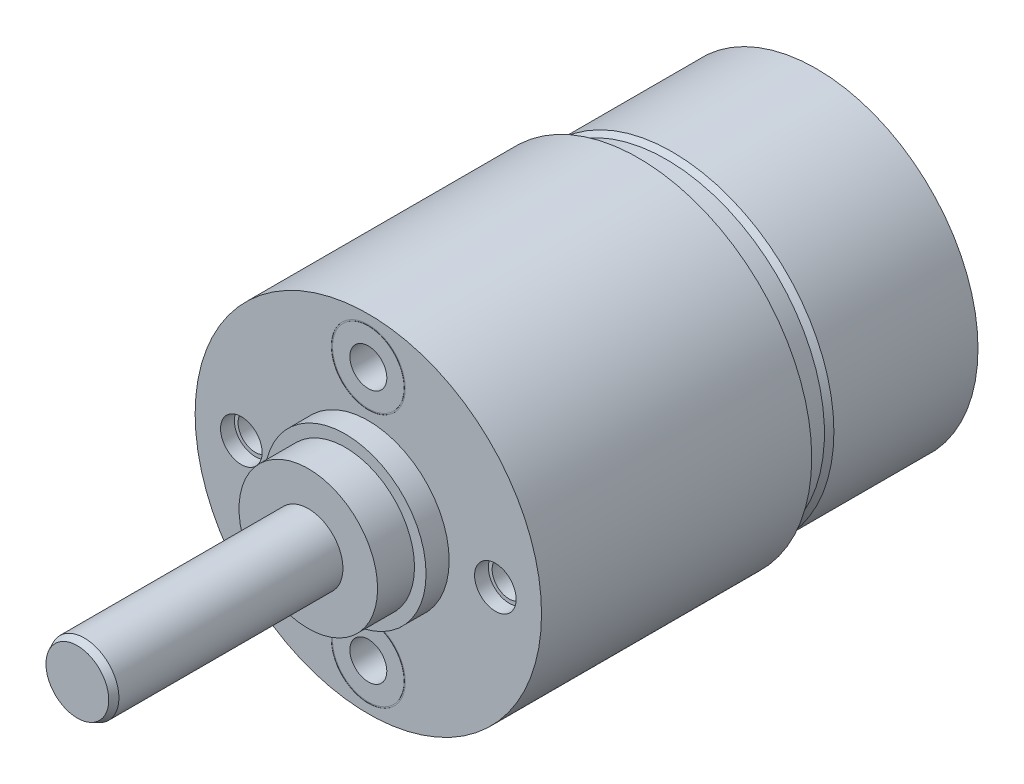
ISO-10303-21;
HEADER;
FILE_DESCRIPTION(('STEP AP214'),'2;1');
FILE_NAME('part.step','',(''),(''),'','','');
FILE_SCHEMA(('AUTOMOTIVE_DESIGN { 1 0 10303 214 1 1 1 1 }'));
ENDSEC;
DATA;
#1=APPLICATION_CONTEXT('core data for automotive mechanical design processes');
#2=APPLICATION_PROTOCOL_DEFINITION('international standard','automotive_design',2000,#1);
#3=PRODUCT_CONTEXT('',#1,'mechanical');
#4=PRODUCT('Part','Part','',(#3));
#5=PRODUCT_RELATED_PRODUCT_CATEGORY('part','',(#4));
#6=PRODUCT_DEFINITION_FORMATION('','',#4);
#7=PRODUCT_DEFINITION_CONTEXT('part definition',#1,'design');
#8=PRODUCT_DEFINITION('design','',#6,#7);
#9=PRODUCT_DEFINITION_SHAPE('','',#8);
#10=(LENGTH_UNIT() NAMED_UNIT(*) SI_UNIT(.MILLI.,.METRE.));
#11=(NAMED_UNIT(*) PLANE_ANGLE_UNIT() SI_UNIT($,.RADIAN.));
#12=(NAMED_UNIT(*) SI_UNIT($,.STERADIAN.) SOLID_ANGLE_UNIT());
#13=UNCERTAINTY_MEASURE_WITH_UNIT(LENGTH_MEASURE(1.E-05),#10,'distance_accuracy_value','');
#14=(GEOMETRIC_REPRESENTATION_CONTEXT(3) GLOBAL_UNCERTAINTY_ASSIGNED_CONTEXT((#13)) GLOBAL_UNIT_ASSIGNED_CONTEXT((#10,
#11,#12)) REPRESENTATION_CONTEXT('',''));
#15=CARTESIAN_POINT('',(0.,0.,0.));
#16=DIRECTION('',(0.,0.,1.));
#17=DIRECTION('',(1.,0.,0.));
#18=AXIS2_PLACEMENT_3D('',#15,#16,#17);
#19=CARTESIAN_POINT('',(0.,0.,-19.4));
#20=DIRECTION('',(0.,0.,-1.));
#21=DIRECTION('',(-1.,0.,0.));
#22=AXIS2_PLACEMENT_3D('',#19,#20,#21);
#23=PLANE('',#22);
#24=CARTESIAN_POINT('',(0.,0.,-19.4));
#25=DIRECTION('',(0.,0.,1.));
#26=DIRECTION('',(1.,0.,0.));
#27=AXIS2_PLACEMENT_3D('',#24,#25,#26);
#28=CIRCLE('',#27,6.4);
#29=CARTESIAN_POINT('',(6.4,0.,-19.4));
#30=VERTEX_POINT('',#29);
#31=EDGE_CURVE('E69',#30,#30,#28,.T.);
#32=ORIENTED_EDGE('',*,*,#31,.T.);
#33=EDGE_LOOP('',(#32));
#34=FACE_BOUND('',#33,.T.);
#35=CARTESIAN_POINT('',(0.,0.,-19.4));
#36=DIRECTION('',(0.,0.,-1.));
#37=DIRECTION('',(-1.,0.,0.));
#38=AXIS2_PLACEMENT_3D('',#35,#36,#37);
#39=CIRCLE('',#38,7.);
#40=CARTESIAN_POINT('',(-7.,0.,-19.4));
#41=VERTEX_POINT('',#40);
#42=EDGE_CURVE('E18',#41,#41,#39,.T.);
#43=ORIENTED_EDGE('',*,*,#42,.T.);
#44=EDGE_LOOP('',(#43));
#45=FACE_BOUND('',#44,.T.);
#46=ADVANCED_FACE('F14',(#34,#45),#23,.T.);
#47=CARTESIAN_POINT('',(0.,0.,0.));
#48=DIRECTION('',(0.,0.,1.));
#49=DIRECTION('',(1.,0.,0.));
#50=AXIS2_PLACEMENT_3D('',#47,#48,#49);
#51=PLANE('',#50);
#52=CARTESIAN_POINT('',(5.5,0.,0.));
#53=DIRECTION('',(0.,0.,-1.));
#54=DIRECTION('',(1.,0.,0.));
#55=AXIS2_PLACEMENT_3D('',#52,#53,#54);
#56=CIRCLE('',#55,0.9);
#57=CARTESIAN_POINT('',(6.4,0.,0.));
#58=VERTEX_POINT('',#57);
#59=EDGE_CURVE('E68',#58,#58,#56,.T.);
#60=ORIENTED_EDGE('',*,*,#59,.T.);
#61=EDGE_LOOP('',(#60));
#62=FACE_BOUND('',#61,.T.);
#63=CARTESIAN_POINT('',(-5.5,0.,0.));
#64=DIRECTION('',(0.,0.,-1.));
#65=DIRECTION('',(-1.,0.,0.));
#66=AXIS2_PLACEMENT_3D('',#63,#64,#65);
#67=CIRCLE('',#66,0.9);
#68=CARTESIAN_POINT('',(-6.4,0.,0.));
#69=VERTEX_POINT('',#68);
#70=EDGE_CURVE('E85',#69,#69,#67,.T.);
#71=ORIENTED_EDGE('',*,*,#70,.T.);
#72=EDGE_LOOP('',(#71));
#73=FACE_BOUND('',#72,.T.);
#74=CARTESIAN_POINT('',(0.,-5.5,0.));
#75=DIRECTION('',(0.,0.,1.));
#76=DIRECTION('',(1.,0.,0.));
#77=AXIS2_PLACEMENT_3D('',#74,#75,#76);
#78=CIRCLE('',#77,1.6);
#79=CARTESIAN_POINT('',(1.6,-5.5,0.));
#80=VERTEX_POINT('',#79);
#81=EDGE_CURVE('E111',#80,#80,#78,.T.);
#82=ORIENTED_EDGE('',*,*,#81,.F.);
#83=EDGE_LOOP('',(#82));
#84=FACE_BOUND('',#83,.T.);
#85=CARTESIAN_POINT('',(0.,0.,0.));
#86=DIRECTION('',(0.,0.,1.));
#87=DIRECTION('',(1.,0.,0.));
#88=AXIS2_PLACEMENT_3D('',#85,#86,#87);
#89=CIRCLE('',#88,3.5);
#90=CARTESIAN_POINT('',(3.5,0.,0.));
#91=VERTEX_POINT('',#90);
#92=EDGE_CURVE('E162',#91,#91,#89,.T.);
#93=ORIENTED_EDGE('',*,*,#92,.F.);
#94=EDGE_LOOP('',(#93));
#95=FACE_BOUND('',#94,.T.);
#96=CARTESIAN_POINT('',(0.,0.,0.));
#97=DIRECTION('',(0.,0.,-1.));
#98=DIRECTION('',(-1.,0.,0.));
#99=AXIS2_PLACEMENT_3D('',#96,#97,#98);
#100=CIRCLE('',#99,7.5);
#101=CARTESIAN_POINT('',(-7.5,0.,0.));
#102=VERTEX_POINT('',#101);
#103=EDGE_CURVE('E158',#102,#102,#100,.T.);
#104=ORIENTED_EDGE('',*,*,#103,.F.);
#105=EDGE_LOOP('',(#104));
#106=FACE_BOUND('',#105,.T.);
#107=CARTESIAN_POINT('',(0.,5.5,0.));
#108=DIRECTION('',(0.,0.,-1.));
#109=DIRECTION('',(1.,0.,0.));
#110=AXIS2_PLACEMENT_3D('',#107,#108,#109);
#111=CIRCLE('',#110,1.6);
#112=CARTESIAN_POINT('',(1.6,5.5,0.));
#113=VERTEX_POINT('',#112);
#114=EDGE_CURVE('E101',#113,#113,#111,.T.);
#115=ORIENTED_EDGE('',*,*,#114,.T.);
#116=EDGE_LOOP('',(#115));
#117=FACE_BOUND('',#116,.T.);
#118=ADVANCED_FACE('F210',(#62,#73,#84,#95,#106,#117),#51,.T.);
#119=CARTESIAN_POINT('',(0.,0.,2.6));
#120=DIRECTION('',(0.,0.,1.));
#121=DIRECTION('',(1.,0.,0.));
#122=AXIS2_PLACEMENT_3D('',#119,#120,#121);
#123=PLANE('',#122);
#124=CARTESIAN_POINT('',(0.,0.,2.6));
#125=DIRECTION('',(0.,0.,1.));
#126=DIRECTION('',(1.,0.,0.));
#127=AXIS2_PLACEMENT_3D('',#124,#125,#126);
#128=CIRCLE('',#127,3.);
#129=CARTESIAN_POINT('',(3.,0.,2.6));
#130=VERTEX_POINT('',#129);
#131=EDGE_CURVE('E150',#130,#130,#128,.T.);
#132=ORIENTED_EDGE('',*,*,#131,.T.);
#133=EDGE_LOOP('',(#132));
#134=FACE_BOUND('',#133,.T.);
#135=CARTESIAN_POINT('',(0.,0.,2.6));
#136=DIRECTION('',(0.,0.,1.));
#137=DIRECTION('',(1.,0.,0.));
#138=AXIS2_PLACEMENT_3D('',#135,#136,#137);
#139=CIRCLE('',#138,1.5);
#140=CARTESIAN_POINT('',(1.5,0.,2.6));
#141=VERTEX_POINT('',#140);
#142=EDGE_CURVE('E146',#141,#141,#139,.F.);
#143=ORIENTED_EDGE('',*,*,#142,.T.);
#144=EDGE_LOOP('',(#143));
#145=FACE_BOUND('',#144,.T.);
#146=ADVANCED_FACE('F215',(#134,#145),#123,.T.);
#147=CARTESIAN_POINT('',(0.,0.,0.));
#148=DIRECTION('',(0.,0.,-1.));
#149=DIRECTION('',(-1.,0.,0.));
#150=AXIS2_PLACEMENT_3D('',#147,#148,#149);
#151=CYLINDRICAL_SURFACE('',#150,7.5);
#152=CARTESIAN_POINT('',(0.,0.,-11.7));
#153=DIRECTION('',(0.,0.,-1.));
#154=DIRECTION('',(-1.,0.,0.));
#155=AXIS2_PLACEMENT_3D('',#152,#153,#154);
#156=CIRCLE('',#155,7.5);
#157=CARTESIAN_POINT('',(-7.5,0.,-11.7));
#158=VERTEX_POINT('',#157);
#159=EDGE_CURVE('E55',#158,#158,#156,.T.);
#160=ORIENTED_EDGE('',*,*,#159,.F.);
#161=EDGE_LOOP('',(#160));
#162=FACE_BOUND('',#161,.T.);
#163=ORIENTED_EDGE('',*,*,#103,.T.);
#164=EDGE_LOOP('',(#163));
#165=FACE_BOUND('',#164,.T.);
#166=ADVANCED_FACE('F221',(#162,#165),#151,.T.);
#167=CARTESIAN_POINT('',(0.,0.,1.));
#168=DIRECTION('',(0.,0.,1.));
#169=DIRECTION('',(1.,0.,0.));
#170=AXIS2_PLACEMENT_3D('',#167,#168,#169);
#171=PLANE('',#170);
#172=CARTESIAN_POINT('',(0.,0.,1.));
#173=DIRECTION('',(0.,0.,1.));
#174=DIRECTION('',(1.,0.,0.));
#175=AXIS2_PLACEMENT_3D('',#172,#173,#174);
#176=CIRCLE('',#175,3.);
#177=CARTESIAN_POINT('',(3.,0.,1.));
#178=VERTEX_POINT('',#177);
#179=EDGE_CURVE('E166',#178,#178,#176,.T.);
#180=ORIENTED_EDGE('',*,*,#179,.F.);
#181=EDGE_LOOP('',(#180));
#182=FACE_BOUND('',#181,.T.);
#183=CARTESIAN_POINT('',(0.,0.,1.));
#184=DIRECTION('',(0.,0.,-1.));
#185=DIRECTION('',(-1.,0.,0.));
#186=AXIS2_PLACEMENT_3D('',#183,#184,#185);
#187=CIRCLE('',#186,3.5);
#188=CARTESIAN_POINT('',(-3.5,0.,1.));
#189=VERTEX_POINT('',#188);
#190=EDGE_CURVE('E154',#189,#189,#187,.T.);
#191=ORIENTED_EDGE('',*,*,#190,.F.);
#192=EDGE_LOOP('',(#191));
#193=FACE_BOUND('',#192,.T.);
#194=ADVANCED_FACE('F223',(#182,#193),#171,.T.);
#195=CARTESIAN_POINT('',(0.,0.,0.));
#196=DIRECTION('',(0.,0.,1.));
#197=DIRECTION('',(1.,0.,0.));
#198=AXIS2_PLACEMENT_3D('',#195,#196,#197);
#199=CYLINDRICAL_SURFACE('',#198,3.5);
#200=ORIENTED_EDGE('',*,*,#190,.T.);
#201=EDGE_LOOP('',(#200));
#202=FACE_BOUND('',#201,.T.);
#203=ORIENTED_EDGE('',*,*,#92,.T.);
#204=EDGE_LOOP('',(#203));
#205=FACE_BOUND('',#204,.T.);
#206=ADVANCED_FACE('F229',(#202,#205),#199,.T.);
#207=CARTESIAN_POINT('',(0.,0.,0.));
#208=DIRECTION('',(0.,0.,1.));
#209=DIRECTION('',(1.,0.,0.));
#210=AXIS2_PLACEMENT_3D('',#207,#208,#209);
#211=CYLINDRICAL_SURFACE('',#210,3.);
#212=ORIENTED_EDGE('',*,*,#179,.T.);
#213=EDGE_LOOP('',(#212));
#214=FACE_BOUND('',#213,.T.);
#215=ORIENTED_EDGE('',*,*,#131,.F.);
#216=EDGE_LOOP('',(#215));
#217=FACE_BOUND('',#216,.T.);
#218=ADVANCED_FACE('F291',(#214,#217),#211,.T.);
#219=CARTESIAN_POINT('',(0.,0.,12.6));
#220=DIRECTION('',(0.,0.,-1.));
#221=DIRECTION('',(-1.,0.,0.));
#222=AXIS2_PLACEMENT_3D('',#219,#220,#221);
#223=CYLINDRICAL_SURFACE('',#222,1.5);
#224=CARTESIAN_POINT('',(0.,0.,12.3));
#225=DIRECTION('',(0.,0.,1.));
#226=DIRECTION('',(1.,0.,0.));
#227=AXIS2_PLACEMENT_3D('',#224,#225,#226);
#228=CIRCLE('',#227,1.5);
#229=CARTESIAN_POINT('',(1.5,0.,12.3));
#230=VERTEX_POINT('',#229);
#231=EDGE_CURVE('E23',#230,#230,#228,.F.);
#232=ORIENTED_EDGE('',*,*,#231,.T.);
#233=EDGE_LOOP('',(#232));
#234=FACE_BOUND('',#233,.T.);
#235=ORIENTED_EDGE('',*,*,#142,.F.);
#236=EDGE_LOOP('',(#235));
#237=FACE_BOUND('',#236,.T.);
#238=ADVANCED_FACE('F288',(#234,#237),#223,.T.);
#239=CARTESIAN_POINT('',(0.,0.,12.6));
#240=DIRECTION('',(0.,0.,1.));
#241=DIRECTION('',(1.,0.,0.));
#242=AXIS2_PLACEMENT_3D('',#239,#240,#241);
#243=PLANE('',#242);
#244=CARTESIAN_POINT('',(0.,0.,12.6));
#245=DIRECTION('',(0.,0.,1.));
#246=DIRECTION('',(1.,0.,0.));
#247=AXIS2_PLACEMENT_3D('',#244,#245,#246);
#248=CIRCLE('',#247,1.3601077025535);
#249=CARTESIAN_POINT('',(1.3601077025535,0.,12.6));
#250=VERTEX_POINT('',#249);
#251=EDGE_CURVE('E33',#250,#250,#248,.T.);
#252=ORIENTED_EDGE('',*,*,#251,.T.);
#253=EDGE_LOOP('',(#252));
#254=FACE_BOUND('',#253,.T.);
#255=ADVANCED_FACE('F285',(#254),#243,.T.);
#256=CARTESIAN_POINT('',(0.,0.,12.6));
#257=DIRECTION('',(0.,0.,-1.));
#258=DIRECTION('',(-1.,0.,0.));
#259=AXIS2_PLACEMENT_3D('',#256,#257,#258);
#260=CONICAL_SURFACE('',#259,1.3601077025535,0.436332312998582);
#261=ORIENTED_EDGE('',*,*,#231,.F.);
#262=EDGE_LOOP('',(#261));
#263=FACE_BOUND('',#262,.T.);
#264=ORIENTED_EDGE('',*,*,#251,.F.);
#265=EDGE_LOOP('',(#264));
#266=FACE_BOUND('',#265,.T.);
#267=ADVANCED_FACE('F16',(#263,#266),#260,.T.);
#268=CARTESIAN_POINT('',(0.,-5.5,-0.01));
#269=DIRECTION('',(0.,0.,1.));
#270=DIRECTION('',(1.,0.,0.));
#271=AXIS2_PLACEMENT_3D('',#268,#269,#270);
#272=CYLINDRICAL_SURFACE('',#271,1.6);
#273=CARTESIAN_POINT('',(0.,-5.5,-0.01));
#274=DIRECTION('',(0.,0.,1.));
#275=DIRECTION('',(1.,0.,0.));
#276=AXIS2_PLACEMENT_3D('',#273,#274,#275);
#277=CIRCLE('',#276,1.6);
#278=CARTESIAN_POINT('',(1.6,-5.5,-0.01));
#279=VERTEX_POINT('',#278);
#280=EDGE_CURVE('E118',#279,#279,#277,.F.);
#281=ORIENTED_EDGE('',*,*,#280,.T.);
#282=EDGE_LOOP('',(#281));
#283=FACE_BOUND('',#282,.T.);
#284=ORIENTED_EDGE('',*,*,#81,.T.);
#285=EDGE_LOOP('',(#284));
#286=FACE_BOUND('',#285,.T.);
#287=ADVANCED_FACE('F266',(#283,#286),#272,.F.);
#288=CARTESIAN_POINT('',(0.,-5.5,-0.01));
#289=DIRECTION('',(0.,0.,1.));
#290=DIRECTION('',(1.,0.,0.));
#291=AXIS2_PLACEMENT_3D('',#288,#289,#290);
#292=CYLINDRICAL_SURFACE('',#291,1.55);
#293=CARTESIAN_POINT('',(0.,-5.5,-0.01));
#294=DIRECTION('',(0.,0.,1.));
#295=DIRECTION('',(1.,0.,0.));
#296=AXIS2_PLACEMENT_3D('',#293,#294,#295);
#297=CIRCLE('',#296,1.55);
#298=CARTESIAN_POINT('',(1.55,-5.5,-0.01));
#299=VERTEX_POINT('',#298);
#300=EDGE_CURVE('E122',#299,#299,#297,.F.);
#301=ORIENTED_EDGE('',*,*,#300,.F.);
#302=EDGE_LOOP('',(#301));
#303=FACE_BOUND('',#302,.T.);
#304=CARTESIAN_POINT('',(0.,-5.5,0.));
#305=DIRECTION('',(0.,0.,1.));
#306=DIRECTION('',(1.,0.,0.));
#307=AXIS2_PLACEMENT_3D('',#304,#305,#306);
#308=CIRCLE('',#307,1.55);
#309=CARTESIAN_POINT('',(1.55,-5.5,0.));
#310=VERTEX_POINT('',#309);
#311=EDGE_CURVE('E123',#310,#310,#308,.T.);
#312=ORIENTED_EDGE('',*,*,#311,.F.);
#313=EDGE_LOOP('',(#312));
#314=FACE_BOUND('',#313,.T.);
#315=ADVANCED_FACE('F262',(#303,#314),#292,.T.);
#316=CARTESIAN_POINT('',(0.,-5.5,-0.01));
#317=DIRECTION('',(0.,0.,1.));
#318=DIRECTION('',(1.,0.,0.));
#319=AXIS2_PLACEMENT_3D('',#316,#317,#318);
#320=PLANE('',#319);
#321=ORIENTED_EDGE('',*,*,#280,.F.);
#322=EDGE_LOOP('',(#321));
#323=FACE_BOUND('',#322,.T.);
#324=ORIENTED_EDGE('',*,*,#300,.T.);
#325=EDGE_LOOP('',(#324));
#326=FACE_BOUND('',#325,.T.);
#327=ADVANCED_FACE('F258',(#323,#326),#320,.T.);
#328=CARTESIAN_POINT('',(0.,-5.5,-4.));
#329=DIRECTION('',(0.,0.,-1.));
#330=DIRECTION('',(1.,0.,0.));
#331=AXIS2_PLACEMENT_3D('',#328,#329,#330);
#332=PLANE('',#331);
#333=CARTESIAN_POINT('',(0.,-5.5,-4.));
#334=DIRECTION('',(0.,0.,-1.));
#335=DIRECTION('',(1.,0.,0.));
#336=AXIS2_PLACEMENT_3D('',#333,#334,#335);
#337=CIRCLE('',#336,0.8);
#338=CARTESIAN_POINT('',(0.8,-5.5,-4.));
#339=VERTEX_POINT('',#338);
#340=EDGE_CURVE('E134',#339,#339,#337,.T.);
#341=ORIENTED_EDGE('',*,*,#340,.F.);
#342=EDGE_LOOP('',(#341));
#343=FACE_BOUND('',#342,.T.);
#344=ADVANCED_FACE('F261',(#343),#332,.F.);
#345=CARTESIAN_POINT('',(0.,-5.5,0.));
#346=DIRECTION('',(0.,0.,-1.));
#347=DIRECTION('',(1.,0.,0.));
#348=AXIS2_PLACEMENT_3D('',#345,#346,#347);
#349=CYLINDRICAL_SURFACE('',#348,0.8);
#350=ORIENTED_EDGE('',*,*,#340,.T.);
#351=EDGE_LOOP('',(#350));
#352=FACE_BOUND('',#351,.T.);
#353=CARTESIAN_POINT('',(0.,-5.5,0.));
#354=DIRECTION('',(0.,0.,-1.));
#355=DIRECTION('',(1.,0.,0.));
#356=AXIS2_PLACEMENT_3D('',#353,#354,#355);
#357=CIRCLE('',#356,0.8);
#358=CARTESIAN_POINT('',(0.8,-5.5,0.));
#359=VERTEX_POINT('',#358);
#360=EDGE_CURVE('E127',#359,#359,#357,.T.);
#361=ORIENTED_EDGE('',*,*,#360,.F.);
#362=EDGE_LOOP('',(#361));
#363=FACE_BOUND('',#362,.T.);
#364=ADVANCED_FACE('F253',(#352,#363),#349,.F.);
#365=ORIENTED_EDGE('',*,*,#360,.T.);
#366=EDGE_LOOP('',(#365));
#367=FACE_BOUND('',#366,.T.);
#368=ORIENTED_EDGE('',*,*,#311,.T.);
#369=EDGE_LOOP('',(#368));
#370=FACE_BOUND('',#369,.T.);
#371=ADVANCED_FACE('F218',(#367,#370),#51,.T.);
#372=CARTESIAN_POINT('',(0.,5.5,-0.01));
#373=DIRECTION('',(0.,0.,1.));
#374=DIRECTION('',(1.,0.,0.));
#375=AXIS2_PLACEMENT_3D('',#372,#373,#374);
#376=CYLINDRICAL_SURFACE('',#375,1.6);
#377=CARTESIAN_POINT('',(0.,5.5,-0.01));
#378=DIRECTION('',(0.,0.,-1.));
#379=DIRECTION('',(1.,0.,0.));
#380=AXIS2_PLACEMENT_3D('',#377,#378,#379);
#381=CIRCLE('',#380,1.6);
#382=CARTESIAN_POINT('',(1.6,5.5,-0.01));
#383=VERTEX_POINT('',#382);
#384=EDGE_CURVE('E102',#383,#383,#381,.F.);
#385=ORIENTED_EDGE('',*,*,#384,.F.);
#386=EDGE_LOOP('',(#385));
#387=FACE_BOUND('',#386,.T.);
#388=ORIENTED_EDGE('',*,*,#114,.F.);
#389=EDGE_LOOP('',(#388));
#390=FACE_BOUND('',#389,.T.);
#391=ADVANCED_FACE('F241',(#387,#390),#376,.F.);
#392=CARTESIAN_POINT('',(0.,5.5,-0.01));
#393=DIRECTION('',(0.,0.,1.));
#394=DIRECTION('',(1.,0.,0.));
#395=AXIS2_PLACEMENT_3D('',#392,#393,#394);
#396=CYLINDRICAL_SURFACE('',#395,1.55);
#397=CARTESIAN_POINT('',(0.,5.5,-0.01));
#398=DIRECTION('',(0.,0.,-1.));
#399=DIRECTION('',(1.,0.,0.));
#400=AXIS2_PLACEMENT_3D('',#397,#398,#399);
#401=CIRCLE('',#400,1.55);
#402=CARTESIAN_POINT('',(1.55,5.5,-0.01));
#403=VERTEX_POINT('',#402);
#404=EDGE_CURVE('E106',#403,#403,#401,.F.);
#405=ORIENTED_EDGE('',*,*,#404,.T.);
#406=EDGE_LOOP('',(#405));
#407=FACE_BOUND('',#406,.T.);
#408=CARTESIAN_POINT('',(0.,5.5,0.));
#409=DIRECTION('',(0.,0.,-1.));
#410=DIRECTION('',(1.,0.,0.));
#411=AXIS2_PLACEMENT_3D('',#408,#409,#410);
#412=CIRCLE('',#411,1.55);
#413=CARTESIAN_POINT('',(1.55,5.5,0.));
#414=VERTEX_POINT('',#413);
#415=EDGE_CURVE('E107',#414,#414,#412,.T.);
#416=ORIENTED_EDGE('',*,*,#415,.T.);
#417=EDGE_LOOP('',(#416));
#418=FACE_BOUND('',#417,.T.);
#419=ADVANCED_FACE('F243',(#407,#418),#396,.T.);
#420=CARTESIAN_POINT('',(0.,5.5,-0.01));
#421=DIRECTION('',(0.,0.,-1.));
#422=DIRECTION('',(-1.,0.,0.));
#423=AXIS2_PLACEMENT_3D('',#420,#421,#422);
#424=PLANE('',#423);
#425=ORIENTED_EDGE('',*,*,#384,.T.);
#426=EDGE_LOOP('',(#425));
#427=FACE_BOUND('',#426,.T.);
#428=ORIENTED_EDGE('',*,*,#404,.F.);
#429=EDGE_LOOP('',(#428));
#430=FACE_BOUND('',#429,.T.);
#431=ADVANCED_FACE('F250',(#427,#430),#424,.F.);
#432=CARTESIAN_POINT('',(0.,5.5,-4.));
#433=DIRECTION('',(0.,0.,-1.));
#434=DIRECTION('',(-1.,0.,0.));
#435=AXIS2_PLACEMENT_3D('',#432,#433,#434);
#436=PLANE('',#435);
#437=CARTESIAN_POINT('',(0.,5.5,-4.));
#438=DIRECTION('',(0.,0.,-1.));
#439=DIRECTION('',(-1.,0.,0.));
#440=AXIS2_PLACEMENT_3D('',#437,#438,#439);
#441=CIRCLE('',#440,0.8);
#442=CARTESIAN_POINT('',(-0.800000000000001,5.5,-4.));
#443=VERTEX_POINT('',#442);
#444=EDGE_CURVE('E142',#443,#443,#441,.T.);
#445=ORIENTED_EDGE('',*,*,#444,.F.);
#446=EDGE_LOOP('',(#445));
#447=FACE_BOUND('',#446,.T.);
#448=ADVANCED_FACE('F277',(#447),#436,.F.);
#449=CARTESIAN_POINT('',(0.,5.5,0.));
#450=DIRECTION('',(0.,0.,-1.));
#451=DIRECTION('',(-1.,0.,0.));
#452=AXIS2_PLACEMENT_3D('',#449,#450,#451);
#453=CYLINDRICAL_SURFACE('',#452,0.8);
#454=ORIENTED_EDGE('',*,*,#444,.T.);
#455=EDGE_LOOP('',(#454));
#456=FACE_BOUND('',#455,.T.);
#457=CARTESIAN_POINT('',(0.,5.5,0.));
#458=DIRECTION('',(0.,0.,-1.));
#459=DIRECTION('',(-1.,0.,0.));
#460=AXIS2_PLACEMENT_3D('',#457,#458,#459);
#461=CIRCLE('',#460,0.8);
#462=CARTESIAN_POINT('',(-0.800000000000001,5.5,0.));
#463=VERTEX_POINT('',#462);
#464=EDGE_CURVE('E138',#463,#463,#461,.T.);
#465=ORIENTED_EDGE('',*,*,#464,.F.);
#466=EDGE_LOOP('',(#465));
#467=FACE_BOUND('',#466,.T.);
#468=ADVANCED_FACE('F280',(#456,#467),#453,.F.);
#469=ORIENTED_EDGE('',*,*,#415,.F.);
#470=EDGE_LOOP('',(#469));
#471=FACE_BOUND('',#470,.T.);
#472=ORIENTED_EDGE('',*,*,#464,.T.);
#473=EDGE_LOOP('',(#472));
#474=FACE_BOUND('',#473,.T.);
#475=ADVANCED_FACE('F219',(#471,#474),#51,.T.);
#476=CARTESIAN_POINT('',(-5.5,0.,-4.));
#477=DIRECTION('',(0.,0.,-1.));
#478=DIRECTION('',(-1.,0.,0.));
#479=AXIS2_PLACEMENT_3D('',#476,#477,#478);
#480=PLANE('',#479);
#481=CARTESIAN_POINT('',(-5.5,0.,-4.));
#482=DIRECTION('',(0.,0.,-1.));
#483=DIRECTION('',(-1.,0.,0.));
#484=AXIS2_PLACEMENT_3D('',#481,#482,#483);
#485=CIRCLE('',#484,0.74);
#486=CARTESIAN_POINT('',(-6.24,0.,-4.));
#487=VERTEX_POINT('',#486);
#488=EDGE_CURVE('E97',#487,#487,#485,.T.);
#489=ORIENTED_EDGE('',*,*,#488,.F.);
#490=EDGE_LOOP('',(#489));
#491=FACE_BOUND('',#490,.T.);
#492=ADVANCED_FACE('F411',(#491),#480,.F.);
#493=CARTESIAN_POINT('',(-5.5,0.,-4.));
#494=DIRECTION('',(0.,0.,-1.));
#495=DIRECTION('',(-1.,0.,0.));
#496=AXIS2_PLACEMENT_3D('',#493,#494,#495);
#497=CYLINDRICAL_SURFACE('',#496,0.74);
#498=ORIENTED_EDGE('',*,*,#488,.T.);
#499=EDGE_LOOP('',(#498));
#500=FACE_BOUND('',#499,.T.);
#501=CARTESIAN_POINT('',(-5.5,0.,-0.6));
#502=DIRECTION('',(0.,0.,-1.));
#503=DIRECTION('',(-1.,0.,0.));
#504=AXIS2_PLACEMENT_3D('',#501,#502,#503);
#505=CIRCLE('',#504,0.74);
#506=CARTESIAN_POINT('',(-6.24,0.,-0.6));
#507=VERTEX_POINT('',#506);
#508=EDGE_CURVE('E93',#507,#507,#505,.T.);
#509=ORIENTED_EDGE('',*,*,#508,.F.);
#510=EDGE_LOOP('',(#509));
#511=FACE_BOUND('',#510,.T.);
#512=ADVANCED_FACE('F421',(#500,#511),#497,.F.);
#513=CARTESIAN_POINT('',(-5.5,0.,-0.6));
#514=DIRECTION('',(0.,0.,-1.));
#515=DIRECTION('',(-1.,0.,0.));
#516=AXIS2_PLACEMENT_3D('',#513,#514,#515);
#517=PLANE('',#516);
#518=ORIENTED_EDGE('',*,*,#508,.T.);
#519=EDGE_LOOP('',(#518));
#520=FACE_BOUND('',#519,.T.);
#521=CARTESIAN_POINT('',(-5.5,0.,-0.6));
#522=DIRECTION('',(0.,0.,-1.));
#523=DIRECTION('',(-1.,0.,0.));
#524=AXIS2_PLACEMENT_3D('',#521,#522,#523);
#525=CIRCLE('',#524,0.9);
#526=CARTESIAN_POINT('',(-6.4,0.,-0.6));
#527=VERTEX_POINT('',#526);
#528=EDGE_CURVE('E89',#527,#527,#525,.T.);
#529=ORIENTED_EDGE('',*,*,#528,.F.);
#530=EDGE_LOOP('',(#529));
#531=FACE_BOUND('',#530,.T.);
#532=ADVANCED_FACE('F432',(#520,#531),#517,.F.);
#533=CARTESIAN_POINT('',(-5.5,0.,0.));
#534=DIRECTION('',(0.,0.,-1.));
#535=DIRECTION('',(-1.,0.,0.));
#536=AXIS2_PLACEMENT_3D('',#533,#534,#535);
#537=CYLINDRICAL_SURFACE('',#536,0.9);
#538=ORIENTED_EDGE('',*,*,#528,.T.);
#539=EDGE_LOOP('',(#538));
#540=FACE_BOUND('',#539,.T.);
#541=ORIENTED_EDGE('',*,*,#70,.F.);
#542=EDGE_LOOP('',(#541));
#543=FACE_BOUND('',#542,.T.);
#544=ADVANCED_FACE('F443',(#540,#543),#537,.F.);
#545=CARTESIAN_POINT('',(5.5,0.,-4.));
#546=DIRECTION('',(0.,0.,-1.));
#547=DIRECTION('',(1.,0.,0.));
#548=AXIS2_PLACEMENT_3D('',#545,#546,#547);
#549=PLANE('',#548);
#550=CARTESIAN_POINT('',(5.5,0.,-4.));
#551=DIRECTION('',(0.,0.,-1.));
#552=DIRECTION('',(1.,0.,0.));
#553=AXIS2_PLACEMENT_3D('',#550,#551,#552);
#554=CIRCLE('',#553,0.74);
#555=CARTESIAN_POINT('',(6.24,0.,-4.));
#556=VERTEX_POINT('',#555);
#557=EDGE_CURVE('E81',#556,#556,#554,.T.);
#558=ORIENTED_EDGE('',*,*,#557,.F.);
#559=EDGE_LOOP('',(#558));
#560=FACE_BOUND('',#559,.T.);
#561=ADVANCED_FACE('F454',(#560),#549,.F.);
#562=CARTESIAN_POINT('',(5.5,0.,-4.));
#563=DIRECTION('',(0.,0.,-1.));
#564=DIRECTION('',(1.,0.,0.));
#565=AXIS2_PLACEMENT_3D('',#562,#563,#564);
#566=CYLINDRICAL_SURFACE('',#565,0.74);
#567=ORIENTED_EDGE('',*,*,#557,.T.);
#568=EDGE_LOOP('',(#567));
#569=FACE_BOUND('',#568,.T.);
#570=CARTESIAN_POINT('',(5.5,0.,-0.6));
#571=DIRECTION('',(0.,0.,-1.));
#572=DIRECTION('',(1.,0.,0.));
#573=AXIS2_PLACEMENT_3D('',#570,#571,#572);
#574=CIRCLE('',#573,0.74);
#575=CARTESIAN_POINT('',(6.24,0.,-0.6));
#576=VERTEX_POINT('',#575);
#577=EDGE_CURVE('E77',#576,#576,#574,.T.);
#578=ORIENTED_EDGE('',*,*,#577,.F.);
#579=EDGE_LOOP('',(#578));
#580=FACE_BOUND('',#579,.T.);
#581=ADVANCED_FACE('F465',(#569,#580),#566,.F.);
#582=CARTESIAN_POINT('',(5.5,0.,-0.6));
#583=DIRECTION('',(0.,0.,-1.));
#584=DIRECTION('',(1.,0.,0.));
#585=AXIS2_PLACEMENT_3D('',#582,#583,#584);
#586=PLANE('',#585);
#587=ORIENTED_EDGE('',*,*,#577,.T.);
#588=EDGE_LOOP('',(#587));
#589=FACE_BOUND('',#588,.T.);
#590=CARTESIAN_POINT('',(5.5,0.,-0.6));
#591=DIRECTION('',(0.,0.,-1.));
#592=DIRECTION('',(1.,0.,0.));
#593=AXIS2_PLACEMENT_3D('',#590,#591,#592);
#594=CIRCLE('',#593,0.9);
#595=CARTESIAN_POINT('',(6.4,0.,-0.6));
#596=VERTEX_POINT('',#595);
#597=EDGE_CURVE('E73',#596,#596,#594,.T.);
#598=ORIENTED_EDGE('',*,*,#597,.F.);
#599=EDGE_LOOP('',(#598));
#600=FACE_BOUND('',#599,.T.);
#601=ADVANCED_FACE('F475',(#589,#600),#586,.F.);
#602=CARTESIAN_POINT('',(5.5,0.,0.));
#603=DIRECTION('',(0.,0.,-1.));
#604=DIRECTION('',(1.,0.,0.));
#605=AXIS2_PLACEMENT_3D('',#602,#603,#604);
#606=CYLINDRICAL_SURFACE('',#605,0.9);
#607=ORIENTED_EDGE('',*,*,#597,.T.);
#608=EDGE_LOOP('',(#607));
#609=FACE_BOUND('',#608,.T.);
#610=ORIENTED_EDGE('',*,*,#59,.F.);
#611=EDGE_LOOP('',(#610));
#612=FACE_BOUND('',#611,.T.);
#613=ADVANCED_FACE('F486',(#609,#612),#606,.F.);
#614=CARTESIAN_POINT('',(7.5,0.,-11.7));
#615=DIRECTION('',(0.,0.,1.));
#616=DIRECTION('',(1.,0.,0.));
#617=AXIS2_PLACEMENT_3D('',#614,#615,#616);
#618=PLANE('',#617);
#619=CARTESIAN_POINT('',(0.,0.,-11.7));
#620=DIRECTION('',(0.,0.,-1.));
#621=DIRECTION('',(-1.,0.,0.));
#622=AXIS2_PLACEMENT_3D('',#619,#620,#621);
#623=CIRCLE('',#622,6.85);
#624=CARTESIAN_POINT('',(-6.85,0.,-11.7));
#625=VERTEX_POINT('',#624);
#626=EDGE_CURVE('E51',#625,#625,#623,.T.);
#627=ORIENTED_EDGE('',*,*,#626,.F.);
#628=EDGE_LOOP('',(#627));
#629=FACE_BOUND('',#628,.T.);
#630=ORIENTED_EDGE('',*,*,#159,.T.);
#631=EDGE_LOOP('',(#630));
#632=FACE_BOUND('',#631,.T.);
#633=ADVANCED_FACE('F497',(#629,#632),#618,.F.);
#634=CARTESIAN_POINT('',(0.,0.,0.));
#635=DIRECTION('',(0.,0.,-1.));
#636=DIRECTION('',(-1.,0.,0.));
#637=AXIS2_PLACEMENT_3D('',#634,#635,#636);
#638=CYLINDRICAL_SURFACE('',#637,6.85);
#639=CARTESIAN_POINT('',(0.,0.,-12.9));
#640=DIRECTION('',(0.,0.,-1.));
#641=DIRECTION('',(-1.,0.,0.));
#642=AXIS2_PLACEMENT_3D('',#639,#640,#641);
#643=CIRCLE('',#642,6.85);
#644=CARTESIAN_POINT('',(-6.85,0.,-12.9));
#645=VERTEX_POINT('',#644);
#646=EDGE_CURVE('E47',#645,#645,#643,.T.);
#647=ORIENTED_EDGE('',*,*,#646,.F.);
#648=EDGE_LOOP('',(#647));
#649=FACE_BOUND('',#648,.T.);
#650=ORIENTED_EDGE('',*,*,#626,.T.);
#651=EDGE_LOOP('',(#650));
#652=FACE_BOUND('',#651,.T.);
#653=ADVANCED_FACE('F508',(#649,#652),#638,.T.);
#654=CARTESIAN_POINT('',(0.,0.,-12.9));
#655=DIRECTION('',(0.,0.,-1.));
#656=DIRECTION('',(-1.,0.,0.));
#657=AXIS2_PLACEMENT_3D('',#654,#655,#656);
#658=CONICAL_SURFACE('',#657,6.85,0.523598775598297);
#659=CARTESIAN_POINT('',(0.,0.,-13.1598076211353));
#660=DIRECTION('',(0.,0.,-1.));
#661=DIRECTION('',(-1.,0.,0.));
#662=AXIS2_PLACEMENT_3D('',#659,#660,#661);
#663=CIRCLE('',#662,7.);
#664=CARTESIAN_POINT('',(-7.,0.,-13.1598076211353));
#665=VERTEX_POINT('',#664);
#666=EDGE_CURVE('E43',#665,#665,#663,.T.);
#667=ORIENTED_EDGE('',*,*,#666,.F.);
#668=EDGE_LOOP('',(#667));
#669=FACE_BOUND('',#668,.T.);
#670=ORIENTED_EDGE('',*,*,#646,.T.);
#671=EDGE_LOOP('',(#670));
#672=FACE_BOUND('',#671,.T.);
#673=ADVANCED_FACE('F519',(#669,#672),#658,.T.);
#674=CARTESIAN_POINT('',(0.,0.,0.));
#675=DIRECTION('',(0.,0.,-1.));
#676=DIRECTION('',(-1.,0.,0.));
#677=AXIS2_PLACEMENT_3D('',#674,#675,#676);
#678=CYLINDRICAL_SURFACE('',#677,7.);
#679=ORIENTED_EDGE('',*,*,#42,.F.);
#680=EDGE_LOOP('',(#679));
#681=FACE_BOUND('',#680,.T.);
#682=ORIENTED_EDGE('',*,*,#666,.T.);
#683=EDGE_LOOP('',(#682));
#684=FACE_BOUND('',#683,.T.);
#685=ADVANCED_FACE('F204',(#681,#684),#678,.T.);
#686=CARTESIAN_POINT('',(0.,0.,-19.15));
#687=DIRECTION('',(0.,0.,1.));
#688=DIRECTION('',(1.,0.,0.));
#689=AXIS2_PLACEMENT_3D('',#686,#687,#688);
#690=PLANE('',#689);
#691=CARTESIAN_POINT('',(0.,0.,-19.15));
#692=DIRECTION('',(0.,0.,-1.));
#693=DIRECTION('',(1.,0.,0.));
#694=AXIS2_PLACEMENT_3D('',#691,#692,#693);
#695=CIRCLE('',#694,6.);
#696=CARTESIAN_POINT('',(6.,0.,-19.15));
#697=VERTEX_POINT('',#696);
#698=EDGE_CURVE('E10',#697,#697,#695,.T.);
#699=ORIENTED_EDGE('',*,*,#698,.F.);
#700=EDGE_LOOP('',(#699));
#701=FACE_BOUND('',#700,.T.);
#702=CARTESIAN_POINT('',(0.,0.,-19.15));
#703=DIRECTION('',(0.,0.,1.));
#704=DIRECTION('',(1.,0.,0.));
#705=AXIS2_PLACEMENT_3D('',#702,#703,#704);
#706=CIRCLE('',#705,6.4);
#707=CARTESIAN_POINT('',(6.4,0.,-19.15));
#708=VERTEX_POINT('',#707);
#709=EDGE_CURVE('E64',#708,#708,#706,.T.);
#710=ORIENTED_EDGE('',*,*,#709,.F.);
#711=EDGE_LOOP('',(#710));
#712=FACE_BOUND('',#711,.T.);
#713=ADVANCED_FACE('F193',(#701,#712),#690,.F.);
#714=CARTESIAN_POINT('',(0.,0.,-19.4));
#715=DIRECTION('',(0.,0.,1.));
#716=DIRECTION('',(1.,0.,0.));
#717=AXIS2_PLACEMENT_3D('',#714,#715,#716);
#718=CYLINDRICAL_SURFACE('',#717,6.4);
#719=ORIENTED_EDGE('',*,*,#709,.T.);
#720=EDGE_LOOP('',(#719));
#721=FACE_BOUND('',#720,.T.);
#722=ORIENTED_EDGE('',*,*,#31,.F.);
#723=EDGE_LOOP('',(#722));
#724=FACE_BOUND('',#723,.T.);
#725=ADVANCED_FACE('F190',(#721,#724),#718,.F.);
#726=CARTESIAN_POINT('',(0.,0.,-19.35));
#727=DIRECTION('',(0.,0.,1.));
#728=DIRECTION('',(1.,0.,0.));
#729=AXIS2_PLACEMENT_3D('',#726,#727,#728);
#730=CYLINDRICAL_SURFACE('',#729,6.);
#731=CARTESIAN_POINT('',(0.,0.,-19.35));
#732=DIRECTION('',(0.,0.,-1.));
#733=DIRECTION('',(1.,0.,0.));
#734=AXIS2_PLACEMENT_3D('',#731,#732,#733);
#735=CIRCLE('',#734,6.);
#736=CARTESIAN_POINT('',(6.,0.,-19.35));
#737=VERTEX_POINT('',#736);
#738=EDGE_CURVE('E42',#737,#737,#735,.T.);
#739=ORIENTED_EDGE('',*,*,#738,.F.);
#740=EDGE_LOOP('',(#739));
#741=FACE_BOUND('',#740,.T.);
#742=ORIENTED_EDGE('',*,*,#698,.T.);
#743=EDGE_LOOP('',(#742));
#744=FACE_BOUND('',#743,.T.);
#745=ADVANCED_FACE('F192',(#741,#744),#730,.T.);
#746=CARTESIAN_POINT('',(0.,0.,-19.35));
#747=DIRECTION('',(0.,0.,1.));
#748=DIRECTION('',(1.,0.,0.));
#749=AXIS2_PLACEMENT_3D('',#746,#747,#748);
#750=CYLINDRICAL_SURFACE('',#749,2.824);
#751=CARTESIAN_POINT('',(0.,0.,-19.35));
#752=DIRECTION('',(0.,0.,-1.));
#753=DIRECTION('',(1.,0.,0.));
#754=AXIS2_PLACEMENT_3D('',#751,#752,#753);
#755=CIRCLE('',#754,2.824);
#756=CARTESIAN_POINT('',(2.824,0.,-19.35));
#757=VERTEX_POINT('',#756);
#758=EDGE_CURVE('E37',#757,#757,#755,.T.);
#759=ORIENTED_EDGE('',*,*,#758,.T.);
#760=EDGE_LOOP('',(#759));
#761=FACE_BOUND('',#760,.T.);
#762=CARTESIAN_POINT('',(0.,0.,-19.15));
#763=DIRECTION('',(0.,0.,-1.));
#764=DIRECTION('',(1.,0.,0.));
#765=AXIS2_PLACEMENT_3D('',#762,#763,#764);
#766=CIRCLE('',#765,2.824);
#767=CARTESIAN_POINT('',(2.824,0.,-19.15));
#768=VERTEX_POINT('',#767);
#769=EDGE_CURVE('E39',#768,#768,#766,.T.);
#770=ORIENTED_EDGE('',*,*,#769,.F.);
#771=EDGE_LOOP('',(#770));
#772=FACE_BOUND('',#771,.T.);
#773=ADVANCED_FACE('F201',(#761,#772),#750,.F.);
#774=CARTESIAN_POINT('',(0.,0.,-19.35));
#775=DIRECTION('',(0.,0.,-1.));
#776=DIRECTION('',(-1.,0.,0.));
#777=AXIS2_PLACEMENT_3D('',#774,#775,#776);
#778=PLANE('',#777);
#779=ORIENTED_EDGE('',*,*,#738,.T.);
#780=EDGE_LOOP('',(#779));
#781=FACE_BOUND('',#780,.T.);
#782=ORIENTED_EDGE('',*,*,#758,.F.);
#783=EDGE_LOOP('',(#782));
#784=FACE_BOUND('',#783,.T.);
#785=ADVANCED_FACE('F569',(#781,#784),#778,.T.);
#786=CARTESIAN_POINT('',(0.,0.,-14.7));
#787=DIRECTION('',(0.,0.,1.));
#788=DIRECTION('',(1.,0.,0.));
#789=AXIS2_PLACEMENT_3D('',#786,#787,#788);
#790=PLANE('',#789);
#791=CARTESIAN_POINT('',(0.,0.,-14.7));
#792=DIRECTION('',(0.,0.,1.));
#793=DIRECTION('',(1.,0.,0.));
#794=AXIS2_PLACEMENT_3D('',#791,#792,#793);
#795=CIRCLE('',#794,2.724);
#796=CARTESIAN_POINT('',(2.724,0.,-14.7));
#797=VERTEX_POINT('',#796);
#798=EDGE_CURVE('E59',#797,#797,#795,.T.);
#799=ORIENTED_EDGE('',*,*,#798,.F.);
#800=EDGE_LOOP('',(#799));
#801=FACE_BOUND('',#800,.T.);
#802=ADVANCED_FACE('F580',(#801),#790,.F.);
#803=CARTESIAN_POINT('',(0.,0.,-19.4));
#804=DIRECTION('',(0.,0.,1.));
#805=DIRECTION('',(1.,0.,0.));
#806=AXIS2_PLACEMENT_3D('',#803,#804,#805);
#807=CYLINDRICAL_SURFACE('',#806,2.724);
#808=ORIENTED_EDGE('',*,*,#798,.T.);
#809=EDGE_LOOP('',(#808));
#810=FACE_BOUND('',#809,.T.);
#811=CARTESIAN_POINT('',(0.,0.,-19.15));
#812=DIRECTION('',(0.,0.,1.));
#813=DIRECTION('',(1.,0.,0.));
#814=AXIS2_PLACEMENT_3D('',#811,#812,#813);
#815=CIRCLE('',#814,2.724);
#816=CARTESIAN_POINT('',(2.724,0.,-19.15));
#817=VERTEX_POINT('',#816);
#818=EDGE_CURVE('E63',#817,#817,#815,.T.);
#819=ORIENTED_EDGE('',*,*,#818,.F.);
#820=EDGE_LOOP('',(#819));
#821=FACE_BOUND('',#820,.T.);
#822=ADVANCED_FACE('F591',(#810,#821),#807,.F.);
#823=ORIENTED_EDGE('',*,*,#818,.T.);
#824=EDGE_LOOP('',(#823));
#825=FACE_BOUND('',#824,.T.);
#826=ORIENTED_EDGE('',*,*,#769,.T.);
#827=EDGE_LOOP('',(#826));
#828=FACE_BOUND('',#827,.T.);
#829=ADVANCED_FACE('F207',(#825,#828),#690,.F.);
#830=CLOSED_SHELL('',(#46,#118,#146,#166,#194,#206,#218,#238,#255,#267,#287,#315,#327,#344,#364,
#371,#391,#419,#431,#448,#468,#475,#492,#512,#532,#544,#561,#581,#601,#613,#633,#653,#673,#685,
#713,#725,#745,#773,#785,#802,#822,#829));
#831=MANIFOLD_SOLID_BREP('B1',#830);
#832=ADVANCED_BREP_SHAPE_REPRESENTATION('',(#18,#831),#14);
#833=SHAPE_DEFINITION_REPRESENTATION(#9,#832);
ENDSEC;
END-ISO-10303-21;
